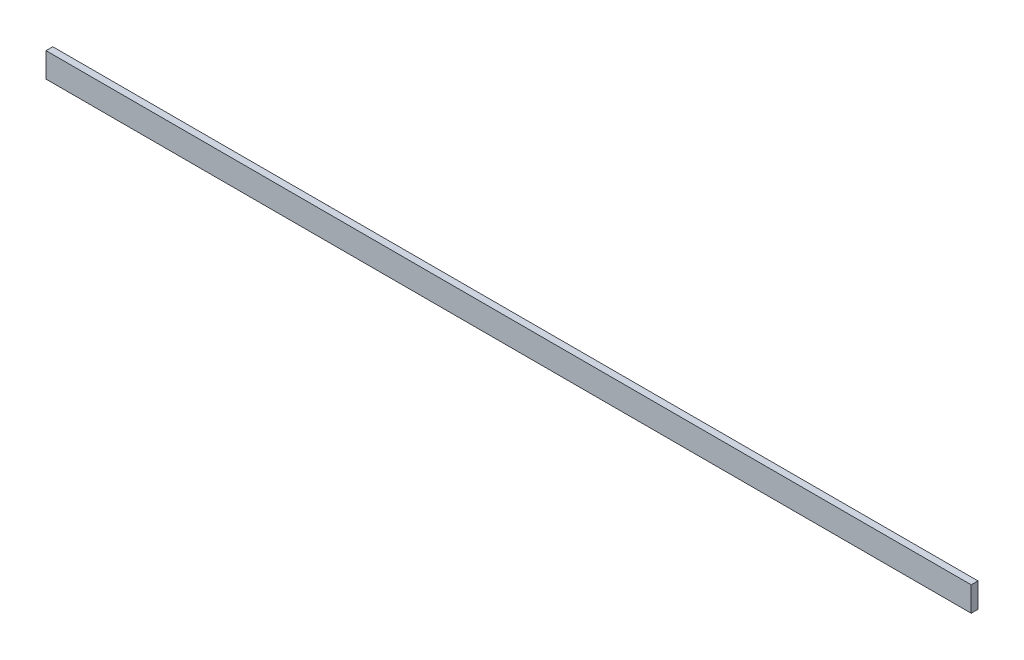
ISO-10303-21;
HEADER;
FILE_DESCRIPTION(('STEP AP214'),'2;1');
FILE_NAME('part.step','',(''),(''),'','','');
FILE_SCHEMA(('AUTOMOTIVE_DESIGN { 1 0 10303 214 1 1 1 1 }'));
ENDSEC;
DATA;
#1=APPLICATION_CONTEXT('core data for automotive mechanical design processes');
#2=APPLICATION_PROTOCOL_DEFINITION('international standard','automotive_design',2000,#1);
#3=PRODUCT_CONTEXT('',#1,'mechanical');
#4=PRODUCT('Part','Part','',(#3));
#5=PRODUCT_RELATED_PRODUCT_CATEGORY('part','',(#4));
#6=PRODUCT_DEFINITION_FORMATION('','',#4);
#7=PRODUCT_DEFINITION_CONTEXT('part definition',#1,'design');
#8=PRODUCT_DEFINITION('design','',#6,#7);
#9=PRODUCT_DEFINITION_SHAPE('','',#8);
#10=(LENGTH_UNIT() NAMED_UNIT(*) SI_UNIT(.MILLI.,.METRE.));
#11=(NAMED_UNIT(*) PLANE_ANGLE_UNIT() SI_UNIT($,.RADIAN.));
#12=(NAMED_UNIT(*) SI_UNIT($,.STERADIAN.) SOLID_ANGLE_UNIT());
#13=UNCERTAINTY_MEASURE_WITH_UNIT(LENGTH_MEASURE(1.E-05),#10,'distance_accuracy_value','');
#14=(GEOMETRIC_REPRESENTATION_CONTEXT(3) GLOBAL_UNCERTAINTY_ASSIGNED_CONTEXT((#13)) GLOBAL_UNIT_ASSIGNED_CONTEXT((#10,
#11,#12)) REPRESENTATION_CONTEXT('',''));
#15=CARTESIAN_POINT('',(0.,0.,0.));
#16=DIRECTION('',(0.,0.,1.));
#17=DIRECTION('',(1.,0.,0.));
#18=AXIS2_PLACEMENT_3D('',#15,#16,#17);
#19=CARTESIAN_POINT('',(0.,80.,0.));
#20=DIRECTION('',(1.,0.,0.));
#21=DIRECTION('',(0.,0.,-1.));
#22=AXIS2_PLACEMENT_3D('',#19,#20,#21);
#23=PLANE('',#22);
#24=DIRECTION('',(0.,0.,1.));
#25=VECTOR('',#24,1.);
#26=CARTESIAN_POINT('',(0.,0.,0.));
#27=LINE('',#26,#25);
#28=CARTESIAN_POINT('',(0.,0.,-22.));
#29=VERTEX_POINT('',#28);
#30=CARTESIAN_POINT('',(0.,0.,0.));
#31=VERTEX_POINT('',#30);
#32=EDGE_CURVE('E94',#29,#31,#27,.T.);
#33=ORIENTED_EDGE('',*,*,#32,.T.);
#34=DIRECTION('',(0.,-1.,0.));
#35=VECTOR('',#34,1.);
#36=CARTESIAN_POINT('',(0.,80.,0.));
#37=LINE('',#36,#35);
#38=CARTESIAN_POINT('',(0.,80.,0.));
#39=VERTEX_POINT('',#38);
#40=EDGE_CURVE('E11',#39,#31,#37,.T.);
#41=ORIENTED_EDGE('',*,*,#40,.F.);
#42=DIRECTION('',(0.,0.,1.));
#43=VECTOR('',#42,1.);
#44=CARTESIAN_POINT('',(0.,80.,0.));
#45=LINE('',#44,#43);
#46=CARTESIAN_POINT('',(0.,80.,-22.));
#47=VERTEX_POINT('',#46);
#48=EDGE_CURVE('E82',#47,#39,#45,.T.);
#49=ORIENTED_EDGE('',*,*,#48,.F.);
#50=DIRECTION('',(0.,-1.,0.));
#51=VECTOR('',#50,1.);
#52=CARTESIAN_POINT('',(0.,80.,-22.));
#53=LINE('',#52,#51);
#54=EDGE_CURVE('E90',#47,#29,#53,.T.);
#55=ORIENTED_EDGE('',*,*,#54,.T.);
#56=EDGE_LOOP('',(#33,#41,#49,#55));
#57=FACE_BOUND('',#56,.T.);
#58=ADVANCED_FACE('F31',(#57),#23,.F.);
#59=CARTESIAN_POINT('',(0.,80.,0.));
#60=DIRECTION('',(0.,0.,-1.));
#61=DIRECTION('',(-1.,0.,0.));
#62=AXIS2_PLACEMENT_3D('',#59,#60,#61);
#63=PLANE('',#62);
#64=DIRECTION('',(1.,0.,0.));
#65=VECTOR('',#64,1.);
#66=CARTESIAN_POINT('',(0.,0.,0.));
#67=LINE('',#66,#65);
#68=CARTESIAN_POINT('',(3000.,0.,0.));
#69=VERTEX_POINT('',#68);
#70=EDGE_CURVE('E86',#31,#69,#67,.T.);
#71=ORIENTED_EDGE('',*,*,#70,.T.);
#72=DIRECTION('',(0.,-1.,0.));
#73=VECTOR('',#72,1.);
#74=CARTESIAN_POINT('',(3000.,80.,0.));
#75=LINE('',#74,#73);
#76=CARTESIAN_POINT('',(3000.,80.,0.));
#77=VERTEX_POINT('',#76);
#78=EDGE_CURVE('E39',#77,#69,#75,.T.);
#79=ORIENTED_EDGE('',*,*,#78,.F.);
#80=DIRECTION('',(1.,0.,0.));
#81=VECTOR('',#80,1.);
#82=CARTESIAN_POINT('',(0.,80.,0.));
#83=LINE('',#82,#81);
#84=EDGE_CURVE('E77',#39,#77,#83,.T.);
#85=ORIENTED_EDGE('',*,*,#84,.F.);
#86=ORIENTED_EDGE('',*,*,#40,.T.);
#87=EDGE_LOOP('',(#71,#79,#85,#86));
#88=FACE_BOUND('',#87,.T.);
#89=ADVANCED_FACE('F85',(#88),#63,.F.);
#90=CARTESIAN_POINT('',(3000.,80.,0.));
#91=DIRECTION('',(-1.,0.,0.));
#92=DIRECTION('',(0.,0.,1.));
#93=AXIS2_PLACEMENT_3D('',#90,#91,#92);
#94=PLANE('',#93);
#95=DIRECTION('',(0.,0.,-1.));
#96=VECTOR('',#95,1.);
#97=CARTESIAN_POINT('',(3000.,0.,0.));
#98=LINE('',#97,#96);
#99=CARTESIAN_POINT('',(3000.,0.,-22.));
#100=VERTEX_POINT('',#99);
#101=EDGE_CURVE('E64',#69,#100,#98,.T.);
#102=ORIENTED_EDGE('',*,*,#101,.T.);
#103=DIRECTION('',(0.,-1.,0.));
#104=VECTOR('',#103,1.);
#105=CARTESIAN_POINT('',(3000.,80.,-22.));
#106=LINE('',#105,#104);
#107=CARTESIAN_POINT('',(3000.,80.,-22.));
#108=VERTEX_POINT('',#107);
#109=EDGE_CURVE('E87',#108,#100,#106,.T.);
#110=ORIENTED_EDGE('',*,*,#109,.F.);
#111=DIRECTION('',(0.,0.,-1.));
#112=VECTOR('',#111,1.);
#113=CARTESIAN_POINT('',(3000.,80.,0.));
#114=LINE('',#113,#112);
#115=EDGE_CURVE('E80',#77,#108,#114,.T.);
#116=ORIENTED_EDGE('',*,*,#115,.F.);
#117=ORIENTED_EDGE('',*,*,#78,.T.);
#118=EDGE_LOOP('',(#102,#110,#116,#117));
#119=FACE_BOUND('',#118,.T.);
#120=ADVANCED_FACE('F88',(#119),#94,.F.);
#121=CARTESIAN_POINT('',(0.,80.,-22.));
#122=DIRECTION('',(0.,0.,1.));
#123=DIRECTION('',(1.,0.,0.));
#124=AXIS2_PLACEMENT_3D('',#121,#122,#123);
#125=PLANE('',#124);
#126=DIRECTION('',(-1.,0.,0.));
#127=VECTOR('',#126,1.);
#128=CARTESIAN_POINT('',(0.,0.,-22.));
#129=LINE('',#128,#127);
#130=EDGE_CURVE('E70',#100,#29,#129,.T.);
#131=ORIENTED_EDGE('',*,*,#130,.T.);
#132=ORIENTED_EDGE('',*,*,#54,.F.);
#133=DIRECTION('',(-1.,0.,0.));
#134=VECTOR('',#133,1.);
#135=CARTESIAN_POINT('',(0.,80.,-22.));
#136=LINE('',#135,#134);
#137=EDGE_CURVE('E47',#108,#47,#136,.T.);
#138=ORIENTED_EDGE('',*,*,#137,.F.);
#139=ORIENTED_EDGE('',*,*,#109,.T.);
#140=EDGE_LOOP('',(#131,#132,#138,#139));
#141=FACE_BOUND('',#140,.T.);
#142=ADVANCED_FACE('F101',(#141),#125,.F.);
#143=CARTESIAN_POINT('',(0.,80.,-22.));
#144=DIRECTION('',(0.,-1.,0.));
#145=DIRECTION('',(0.,0.,-1.));
#146=AXIS2_PLACEMENT_3D('',#143,#144,#145);
#147=PLANE('',#146);
#148=ORIENTED_EDGE('',*,*,#48,.T.);
#149=ORIENTED_EDGE('',*,*,#84,.T.);
#150=ORIENTED_EDGE('',*,*,#115,.T.);
#151=ORIENTED_EDGE('',*,*,#137,.T.);
#152=EDGE_LOOP('',(#148,#149,#150,#151));
#153=FACE_BOUND('',#152,.T.);
#154=ADVANCED_FACE('F78',(#153),#147,.F.);
#155=CARTESIAN_POINT('',(0.,0.,-22.));
#156=DIRECTION('',(0.,-1.,0.));
#157=DIRECTION('',(0.,0.,-1.));
#158=AXIS2_PLACEMENT_3D('',#155,#156,#157);
#159=PLANE('',#158);
#160=ORIENTED_EDGE('',*,*,#32,.F.);
#161=ORIENTED_EDGE('',*,*,#130,.F.);
#162=ORIENTED_EDGE('',*,*,#101,.F.);
#163=ORIENTED_EDGE('',*,*,#70,.F.);
#164=EDGE_LOOP('',(#160,#161,#162,#163));
#165=FACE_BOUND('',#164,.T.);
#166=ADVANCED_FACE('F104',(#165),#159,.T.);
#167=CLOSED_SHELL('',(#58,#89,#120,#142,#154,#166));
#168=MANIFOLD_SOLID_BREP('B2',#167);
#169=ADVANCED_BREP_SHAPE_REPRESENTATION('',(#18,#168),#14);
#170=SHAPE_DEFINITION_REPRESENTATION(#9,#169);
ENDSEC;
END-ISO-10303-21;
